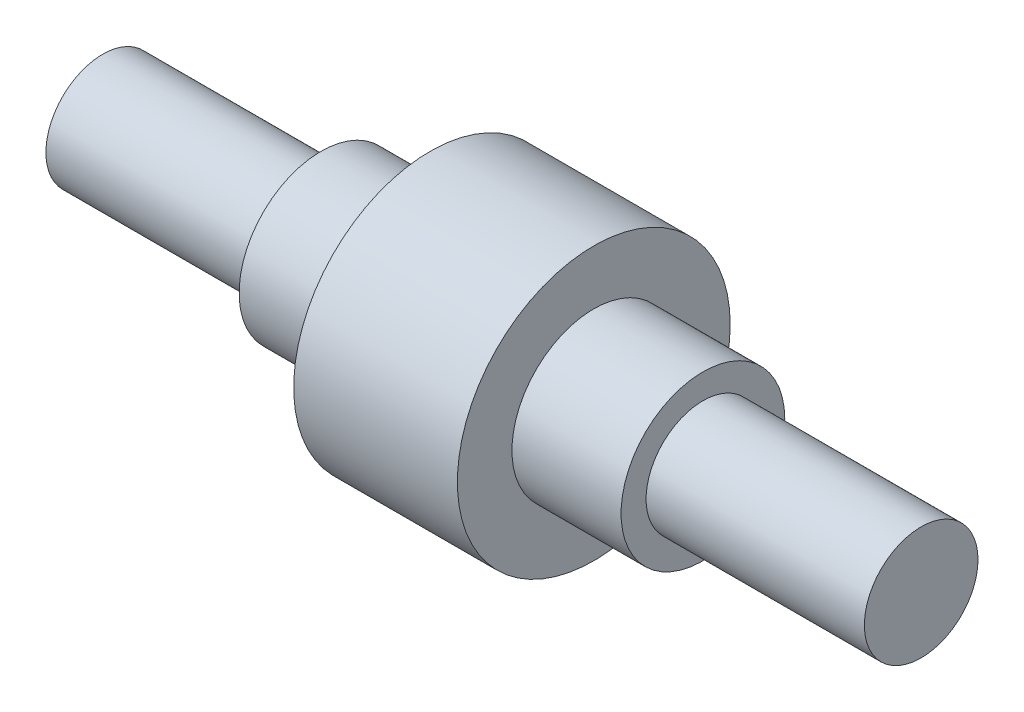
ISO-10303-21;
HEADER;
FILE_DESCRIPTION(('STEP AP214'),'2;1');
FILE_NAME('part.step','',(''),(''),'','','');
FILE_SCHEMA(('AUTOMOTIVE_DESIGN { 1 0 10303 214 1 1 1 1 }'));
ENDSEC;
DATA;
#1=APPLICATION_CONTEXT('core data for automotive mechanical design processes');
#2=APPLICATION_PROTOCOL_DEFINITION('international standard','automotive_design',2000,#1);
#3=PRODUCT_CONTEXT('',#1,'mechanical');
#4=PRODUCT('Part','Part','',(#3));
#5=PRODUCT_RELATED_PRODUCT_CATEGORY('part','',(#4));
#6=PRODUCT_DEFINITION_FORMATION('','',#4);
#7=PRODUCT_DEFINITION_CONTEXT('part definition',#1,'design');
#8=PRODUCT_DEFINITION('design','',#6,#7);
#9=PRODUCT_DEFINITION_SHAPE('','',#8);
#10=(LENGTH_UNIT() NAMED_UNIT(*) SI_UNIT(.MILLI.,.METRE.));
#11=(NAMED_UNIT(*) PLANE_ANGLE_UNIT() SI_UNIT($,.RADIAN.));
#12=(NAMED_UNIT(*) SI_UNIT($,.STERADIAN.) SOLID_ANGLE_UNIT());
#13=UNCERTAINTY_MEASURE_WITH_UNIT(LENGTH_MEASURE(1.E-05),#10,'distance_accuracy_value','');
#14=(GEOMETRIC_REPRESENTATION_CONTEXT(3) GLOBAL_UNCERTAINTY_ASSIGNED_CONTEXT((#13)) GLOBAL_UNIT_ASSIGNED_CONTEXT((#10,
#11,#12)) REPRESENTATION_CONTEXT('',''));
#15=CARTESIAN_POINT('',(0.,0.,0.));
#16=DIRECTION('',(0.,0.,1.));
#17=DIRECTION('',(1.,0.,0.));
#18=AXIS2_PLACEMENT_3D('',#15,#16,#17);
#19=CARTESIAN_POINT('',(30.,-50.,0.));
#20=DIRECTION('',(-1.,0.,0.));
#21=DIRECTION('',(0.,0.,1.));
#22=AXIS2_PLACEMENT_3D('',#19,#20,#21);
#23=PLANE('',#22);
#24=CARTESIAN_POINT('',(30.,0.,0.));
#25=DIRECTION('',(1.,0.,0.));
#26=DIRECTION('',(0.,0.,-1.));
#27=AXIS2_PLACEMENT_3D('',#24,#25,#26);
#28=CIRCLE('',#27,30.);
#29=CARTESIAN_POINT('',(30.,0.,-30.));
#30=VERTEX_POINT('',#29);
#31=EDGE_CURVE('E65',#30,#30,#28,.T.);
#32=ORIENTED_EDGE('',*,*,#31,.F.);
#33=EDGE_LOOP('',(#32));
#34=FACE_BOUND('',#33,.T.);
#35=CARTESIAN_POINT('',(30.,0.,0.));
#36=DIRECTION('',(1.,0.,0.));
#37=DIRECTION('',(0.,0.,-1.));
#38=AXIS2_PLACEMENT_3D('',#35,#36,#37);
#39=CIRCLE('',#38,50.);
#40=CARTESIAN_POINT('',(30.,0.,-50.));
#41=VERTEX_POINT('',#40);
#42=EDGE_CURVE('E10',#41,#41,#39,.T.);
#43=ORIENTED_EDGE('',*,*,#42,.T.);
#44=EDGE_LOOP('',(#43));
#45=FACE_BOUND('',#44,.T.);
#46=ADVANCED_FACE('F31',(#34,#45),#23,.F.);
#47=CARTESIAN_POINT('',(0.,0.,0.));
#48=DIRECTION('',(1.,0.,0.));
#49=DIRECTION('',(0.,0.,-1.));
#50=AXIS2_PLACEMENT_3D('',#47,#48,#49);
#51=CYLINDRICAL_SURFACE('',#50,50.);
#52=ORIENTED_EDGE('',*,*,#42,.F.);
#53=EDGE_LOOP('',(#52));
#54=FACE_BOUND('',#53,.T.);
#55=CARTESIAN_POINT('',(-30.,0.,0.));
#56=DIRECTION('',(1.,0.,0.));
#57=DIRECTION('',(0.,0.,-1.));
#58=AXIS2_PLACEMENT_3D('',#55,#56,#57);
#59=CIRCLE('',#58,50.);
#60=CARTESIAN_POINT('',(-30.,0.,-50.));
#61=VERTEX_POINT('',#60);
#62=EDGE_CURVE('E37',#61,#61,#59,.T.);
#63=ORIENTED_EDGE('',*,*,#62,.T.);
#64=EDGE_LOOP('',(#63));
#65=FACE_BOUND('',#64,.T.);
#66=ADVANCED_FACE('F72',(#54,#65),#51,.T.);
#67=CARTESIAN_POINT('',(-30.,-50.,0.));
#68=DIRECTION('',(1.,0.,0.));
#69=DIRECTION('',(0.,0.,-1.));
#70=AXIS2_PLACEMENT_3D('',#67,#68,#69);
#71=PLANE('',#70);
#72=ORIENTED_EDGE('',*,*,#62,.F.);
#73=EDGE_LOOP('',(#72));
#74=FACE_BOUND('',#73,.T.);
#75=CARTESIAN_POINT('',(-30.,0.,0.));
#76=DIRECTION('',(1.,0.,0.));
#77=DIRECTION('',(0.,0.,-1.));
#78=AXIS2_PLACEMENT_3D('',#75,#76,#77);
#79=CIRCLE('',#78,30.);
#80=CARTESIAN_POINT('',(-30.,0.,-30.));
#81=VERTEX_POINT('',#80);
#82=EDGE_CURVE('E41',#81,#81,#79,.T.);
#83=ORIENTED_EDGE('',*,*,#82,.T.);
#84=EDGE_LOOP('',(#83));
#85=FACE_BOUND('',#84,.T.);
#86=ADVANCED_FACE('F76',(#74,#85),#71,.F.);
#87=CARTESIAN_POINT('',(0.,0.,0.));
#88=DIRECTION('',(1.,0.,0.));
#89=DIRECTION('',(0.,0.,-1.));
#90=AXIS2_PLACEMENT_3D('',#87,#88,#89);
#91=CYLINDRICAL_SURFACE('',#90,30.);
#92=ORIENTED_EDGE('',*,*,#82,.F.);
#93=EDGE_LOOP('',(#92));
#94=FACE_BOUND('',#93,.T.);
#95=CARTESIAN_POINT('',(-70.,0.,0.));
#96=DIRECTION('',(1.,0.,0.));
#97=DIRECTION('',(0.,0.,-1.));
#98=AXIS2_PLACEMENT_3D('',#95,#96,#97);
#99=CIRCLE('',#98,30.);
#100=CARTESIAN_POINT('',(-70.,0.,-30.));
#101=VERTEX_POINT('',#100);
#102=EDGE_CURVE('E45',#101,#101,#99,.T.);
#103=ORIENTED_EDGE('',*,*,#102,.T.);
#104=EDGE_LOOP('',(#103));
#105=FACE_BOUND('',#104,.T.);
#106=ADVANCED_FACE('F81',(#94,#105),#91,.T.);
#107=CARTESIAN_POINT('',(-70.,-30.,0.));
#108=DIRECTION('',(1.,0.,0.));
#109=DIRECTION('',(0.,0.,-1.));
#110=AXIS2_PLACEMENT_3D('',#107,#108,#109);
#111=PLANE('',#110);
#112=ORIENTED_EDGE('',*,*,#102,.F.);
#113=EDGE_LOOP('',(#112));
#114=FACE_BOUND('',#113,.T.);
#115=CARTESIAN_POINT('',(-70.,0.,0.));
#116=DIRECTION('',(1.,0.,0.));
#117=DIRECTION('',(0.,0.,-1.));
#118=AXIS2_PLACEMENT_3D('',#115,#116,#117);
#119=CIRCLE('',#118,20.8256007305626);
#120=CARTESIAN_POINT('',(-70.,0.,-20.8256007305626));
#121=VERTEX_POINT('',#120);
#122=EDGE_CURVE('E50',#121,#121,#119,.T.);
#123=ORIENTED_EDGE('',*,*,#122,.T.);
#124=EDGE_LOOP('',(#123));
#125=FACE_BOUND('',#124,.T.);
#126=ADVANCED_FACE('F87',(#114,#125),#111,.F.);
#127=CARTESIAN_POINT('',(0.,0.,0.));
#128=DIRECTION('',(1.,0.,0.));
#129=DIRECTION('',(0.,0.,-1.));
#130=AXIS2_PLACEMENT_3D('',#127,#128,#129);
#131=CYLINDRICAL_SURFACE('',#130,20.8256007305626);
#132=ORIENTED_EDGE('',*,*,#122,.F.);
#133=EDGE_LOOP('',(#132));
#134=FACE_BOUND('',#133,.T.);
#135=CARTESIAN_POINT('',(-150.,0.,0.));
#136=DIRECTION('',(1.,0.,0.));
#137=DIRECTION('',(0.,0.,-1.));
#138=AXIS2_PLACEMENT_3D('',#135,#136,#137);
#139=CIRCLE('',#138,20.8256007305626);
#140=CARTESIAN_POINT('',(-150.,0.,-20.8256007305626));
#141=VERTEX_POINT('',#140);
#142=EDGE_CURVE('E53',#141,#141,#139,.T.);
#143=ORIENTED_EDGE('',*,*,#142,.T.);
#144=EDGE_LOOP('',(#143));
#145=FACE_BOUND('',#144,.T.);
#146=ADVANCED_FACE('F91',(#134,#145),#131,.T.);
#147=CARTESIAN_POINT('',(-150.,0.,0.));
#148=DIRECTION('',(1.,0.,0.));
#149=DIRECTION('',(0.,0.,-1.));
#150=AXIS2_PLACEMENT_3D('',#147,#148,#149);
#151=PLANE('',#150);
#152=ORIENTED_EDGE('',*,*,#142,.F.);
#153=EDGE_LOOP('',(#152));
#154=FACE_BOUND('',#153,.T.);
#155=ADVANCED_FACE('F95',(#154),#151,.F.);
#156=CARTESIAN_POINT('',(150.,0.,0.));
#157=DIRECTION('',(-1.,0.,0.));
#158=DIRECTION('',(0.,0.,1.));
#159=AXIS2_PLACEMENT_3D('',#156,#157,#158);
#160=PLANE('',#159);
#161=CARTESIAN_POINT('',(150.,0.,0.));
#162=DIRECTION('',(1.,0.,0.));
#163=DIRECTION('',(0.,0.,-1.));
#164=AXIS2_PLACEMENT_3D('',#161,#162,#163);
#165=CIRCLE('',#164,20.8256007305626);
#166=CARTESIAN_POINT('',(150.,0.,-20.8256007305626));
#167=VERTEX_POINT('',#166);
#168=EDGE_CURVE('E56',#167,#167,#165,.T.);
#169=ORIENTED_EDGE('',*,*,#168,.T.);
#170=EDGE_LOOP('',(#169));
#171=FACE_BOUND('',#170,.T.);
#172=ADVANCED_FACE('F99',(#171),#160,.F.);
#173=CARTESIAN_POINT('',(0.,0.,0.));
#174=DIRECTION('',(1.,0.,0.));
#175=DIRECTION('',(0.,0.,-1.));
#176=AXIS2_PLACEMENT_3D('',#173,#174,#175);
#177=CYLINDRICAL_SURFACE('',#176,20.8256007305626);
#178=ORIENTED_EDGE('',*,*,#168,.F.);
#179=EDGE_LOOP('',(#178));
#180=FACE_BOUND('',#179,.T.);
#181=CARTESIAN_POINT('',(70.,0.,0.));
#182=DIRECTION('',(1.,0.,0.));
#183=DIRECTION('',(0.,0.,-1.));
#184=AXIS2_PLACEMENT_3D('',#181,#182,#183);
#185=CIRCLE('',#184,20.8256007305626);
#186=CARTESIAN_POINT('',(70.,0.,-20.8256007305626));
#187=VERTEX_POINT('',#186);
#188=EDGE_CURVE('E59',#187,#187,#185,.T.);
#189=ORIENTED_EDGE('',*,*,#188,.T.);
#190=EDGE_LOOP('',(#189));
#191=FACE_BOUND('',#190,.T.);
#192=ADVANCED_FACE('F103',(#180,#191),#177,.T.);
#193=CARTESIAN_POINT('',(70.,-30.,0.));
#194=DIRECTION('',(-1.,0.,0.));
#195=DIRECTION('',(0.,0.,1.));
#196=AXIS2_PLACEMENT_3D('',#193,#194,#195);
#197=PLANE('',#196);
#198=ORIENTED_EDGE('',*,*,#188,.F.);
#199=EDGE_LOOP('',(#198));
#200=FACE_BOUND('',#199,.T.);
#201=CARTESIAN_POINT('',(70.,0.,0.));
#202=DIRECTION('',(1.,0.,0.));
#203=DIRECTION('',(0.,0.,-1.));
#204=AXIS2_PLACEMENT_3D('',#201,#202,#203);
#205=CIRCLE('',#204,30.);
#206=CARTESIAN_POINT('',(70.,0.,-30.));
#207=VERTEX_POINT('',#206);
#208=EDGE_CURVE('E62',#207,#207,#205,.T.);
#209=ORIENTED_EDGE('',*,*,#208,.T.);
#210=EDGE_LOOP('',(#209));
#211=FACE_BOUND('',#210,.T.);
#212=ADVANCED_FACE('F107',(#200,#211),#197,.F.);
#213=CARTESIAN_POINT('',(0.,0.,0.));
#214=DIRECTION('',(1.,0.,0.));
#215=DIRECTION('',(0.,0.,-1.));
#216=AXIS2_PLACEMENT_3D('',#213,#214,#215);
#217=CYLINDRICAL_SURFACE('',#216,30.);
#218=ORIENTED_EDGE('',*,*,#208,.F.);
#219=EDGE_LOOP('',(#218));
#220=FACE_BOUND('',#219,.T.);
#221=ORIENTED_EDGE('',*,*,#31,.T.);
#222=EDGE_LOOP('',(#221));
#223=FACE_BOUND('',#222,.T.);
#224=ADVANCED_FACE('F69',(#220,#223),#217,.T.);
#225=CLOSED_SHELL('',(#46,#66,#86,#106,#126,#146,#155,#172,#192,#212,#224));
#226=MANIFOLD_SOLID_BREP('B2',#225);
#227=ADVANCED_BREP_SHAPE_REPRESENTATION('',(#18,#226),#14);
#228=SHAPE_DEFINITION_REPRESENTATION(#9,#227);
ENDSEC;
END-ISO-10303-21;
